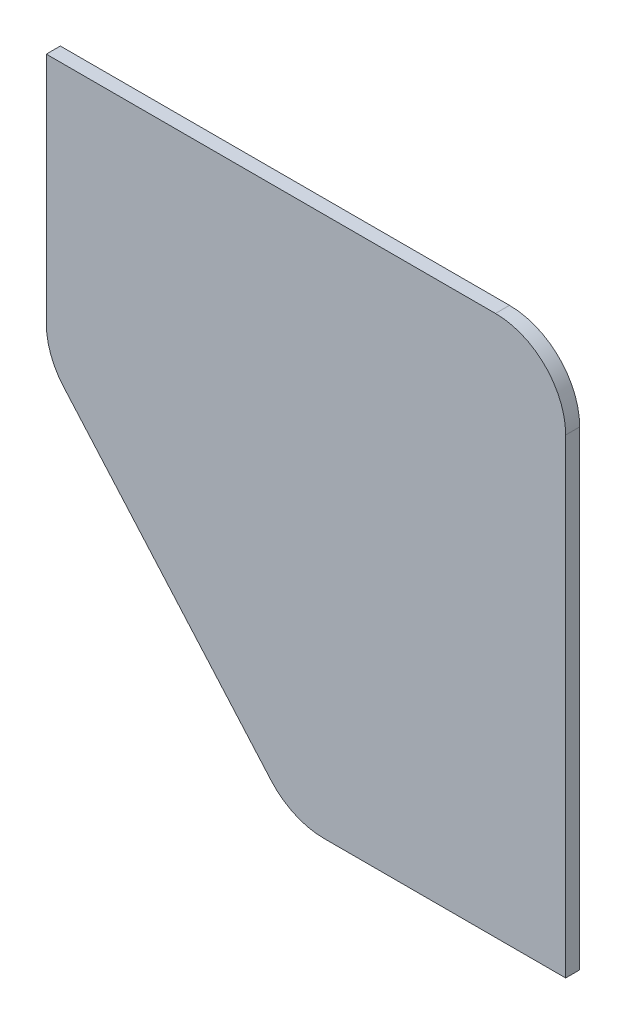
ISO-10303-21;
HEADER;
FILE_DESCRIPTION(('STEP AP214'),'2;1');
FILE_NAME('part.step','',(''),(''),'','','');
FILE_SCHEMA(('AUTOMOTIVE_DESIGN { 1 0 10303 214 1 1 1 1 }'));
ENDSEC;
DATA;
#1=APPLICATION_CONTEXT('core data for automotive mechanical design processes');
#2=APPLICATION_PROTOCOL_DEFINITION('international standard','automotive_design',2000,#1);
#3=PRODUCT_CONTEXT('',#1,'mechanical');
#4=PRODUCT('Part','Part','',(#3));
#5=PRODUCT_RELATED_PRODUCT_CATEGORY('part','',(#4));
#6=PRODUCT_DEFINITION_FORMATION('','',#4);
#7=PRODUCT_DEFINITION_CONTEXT('part definition',#1,'design');
#8=PRODUCT_DEFINITION('design','',#6,#7);
#9=PRODUCT_DEFINITION_SHAPE('','',#8);
#10=(LENGTH_UNIT() NAMED_UNIT(*) SI_UNIT(.MILLI.,.METRE.));
#11=(NAMED_UNIT(*) PLANE_ANGLE_UNIT() SI_UNIT($,.RADIAN.));
#12=(NAMED_UNIT(*) SI_UNIT($,.STERADIAN.) SOLID_ANGLE_UNIT());
#13=UNCERTAINTY_MEASURE_WITH_UNIT(LENGTH_MEASURE(1.E-05),#10,'distance_accuracy_value','');
#14=(GEOMETRIC_REPRESENTATION_CONTEXT(3) GLOBAL_UNCERTAINTY_ASSIGNED_CONTEXT((#13)) GLOBAL_UNIT_ASSIGNED_CONTEXT((#10,
#11,#12)) REPRESENTATION_CONTEXT('',''));
#15=CARTESIAN_POINT('',(0.,0.,0.));
#16=DIRECTION('',(0.,0.,1.));
#17=DIRECTION('',(1.,0.,0.));
#18=AXIS2_PLACEMENT_3D('',#15,#16,#17);
#19=CARTESIAN_POINT('',(-22.1656855955678,34.0263157894737,2.));
#20=DIRECTION('',(0.,0.,-1.));
#21=DIRECTION('',(-1.,0.,0.));
#22=AXIS2_PLACEMENT_3D('',#19,#20,#21);
#23=CYLINDRICAL_SURFACE('',#22,10.);
#24=DIRECTION('',(0.,0.,-1.));
#25=VECTOR('',#24,1.);
#26=CARTESIAN_POINT('',(-22.1656855955678,44.0263157894737,2.));
#27=LINE('',#26,#25);
#28=CARTESIAN_POINT('',(-22.1656855955678,44.0263157894737,2.));
#29=VERTEX_POINT('',#28);
#30=CARTESIAN_POINT('',(-22.1656855955678,44.0263157894737,0.));
#31=VERTEX_POINT('',#30);
#32=EDGE_CURVE('E154',#29,#31,#27,.T.);
#33=ORIENTED_EDGE('',*,*,#32,.F.);
#34=CARTESIAN_POINT('',(-22.1656855955678,34.0263157894737,2.));
#35=DIRECTION('',(0.,0.,1.));
#36=DIRECTION('',(1.,0.,0.));
#37=AXIS2_PLACEMENT_3D('',#34,#35,#36);
#38=CIRCLE('',#37,10.);
#39=CARTESIAN_POINT('',(-12.1656855955678,34.0263157894737,2.));
#40=VERTEX_POINT('',#39);
#41=EDGE_CURVE('E39',#40,#29,#38,.T.);
#42=ORIENTED_EDGE('',*,*,#41,.F.);
#43=DIRECTION('',(0.,0.,-1.));
#44=VECTOR('',#43,1.);
#45=CARTESIAN_POINT('',(-12.1656855955678,34.0263157894737,2.));
#46=LINE('',#45,#44);
#47=CARTESIAN_POINT('',(-12.1656855955678,34.0263157894737,0.));
#48=VERTEX_POINT('',#47);
#49=EDGE_CURVE('E117',#48,#40,#46,.F.);
#50=ORIENTED_EDGE('',*,*,#49,.F.);
#51=CARTESIAN_POINT('',(-22.1656855955678,34.0263157894737,0.));
#52=DIRECTION('',(0.,0.,1.));
#53=DIRECTION('',(1.,0.,0.));
#54=AXIS2_PLACEMENT_3D('',#51,#52,#53);
#55=CIRCLE('',#54,10.);
#56=EDGE_CURVE('E11',#31,#48,#55,.F.);
#57=ORIENTED_EDGE('',*,*,#56,.F.);
#58=EDGE_LOOP('',(#33,#42,#50,#57));
#59=FACE_BOUND('',#58,.T.);
#60=ADVANCED_FACE('F32',(#59),#23,.T.);
#61=CARTESIAN_POINT('',(-46.6280033296495,-22.9736842105263,2.));
#62=DIRECTION('',(0.,0.,1.));
#63=DIRECTION('',(1.,0.,0.));
#64=AXIS2_PLACEMENT_3D('',#61,#62,#63);
#65=CYLINDRICAL_SURFACE('',#64,10.);
#66=DIRECTION('',(0.,0.,-1.));
#67=VECTOR('',#66,1.);
#68=CARTESIAN_POINT('',(-46.6280033296495,-32.9736842105263,2.));
#69=LINE('',#68,#67);
#70=CARTESIAN_POINT('',(-46.6280033296495,-32.9736842105263,2.));
#71=VERTEX_POINT('',#70);
#72=CARTESIAN_POINT('',(-46.6280033296495,-32.9736842105263,0.));
#73=VERTEX_POINT('',#72);
#74=EDGE_CURVE('E146',#71,#73,#69,.T.);
#75=ORIENTED_EDGE('',*,*,#74,.F.);
#76=CARTESIAN_POINT('',(-46.6280033296495,-22.9736842105263,2.));
#77=DIRECTION('',(0.,0.,1.));
#78=DIRECTION('',(1.,0.,0.));
#79=AXIS2_PLACEMENT_3D('',#76,#77,#78);
#80=CIRCLE('',#79,10.);
#81=CARTESIAN_POINT('',(-54.1537702767183,-29.5587302892115,2.));
#82=VERTEX_POINT('',#81);
#83=EDGE_CURVE('E100',#82,#71,#80,.T.);
#84=ORIENTED_EDGE('',*,*,#83,.F.);
#85=DIRECTION('',(0.,0.,-1.));
#86=VECTOR('',#85,1.);
#87=CARTESIAN_POINT('',(-54.1537702767183,-29.5587302892115,2.));
#88=LINE('',#87,#86);
#89=CARTESIAN_POINT('',(-54.1537702767183,-29.5587302892115,0.));
#90=VERTEX_POINT('',#89);
#91=EDGE_CURVE('E148',#90,#82,#88,.F.);
#92=ORIENTED_EDGE('',*,*,#91,.F.);
#93=CARTESIAN_POINT('',(-46.6280033296495,-22.9736842105263,0.));
#94=DIRECTION('',(0.,0.,1.));
#95=DIRECTION('',(1.,0.,0.));
#96=AXIS2_PLACEMENT_3D('',#93,#94,#95);
#97=CIRCLE('',#96,10.);
#98=EDGE_CURVE('E152',#73,#90,#97,.F.);
#99=ORIENTED_EDGE('',*,*,#98,.F.);
#100=EDGE_LOOP('',(#75,#84,#92,#99));
#101=FACE_BOUND('',#100,.T.);
#102=ADVANCED_FACE('F175',(#101),#65,.T.);
#103=CARTESIAN_POINT('',(-76.1656855955678,10.7836669505232,2.));
#104=DIRECTION('',(0.,0.,-1.));
#105=DIRECTION('',(-1.,0.,0.));
#106=AXIS2_PLACEMENT_3D('',#103,#104,#105);
#107=CYLINDRICAL_SURFACE('',#106,10.);
#108=DIRECTION('',(0.,0.,1.));
#109=VECTOR('',#108,1.);
#110=CARTESIAN_POINT('',(-86.1656855955678,10.7836669505232,2.));
#111=LINE('',#110,#109);
#112=CARTESIAN_POINT('',(-86.1656855955678,10.7836669505232,0.));
#113=VERTEX_POINT('',#112);
#114=CARTESIAN_POINT('',(-86.1656855955678,10.7836669505232,2.));
#115=VERTEX_POINT('',#114);
#116=EDGE_CURVE('E136',#113,#115,#111,.T.);
#117=ORIENTED_EDGE('',*,*,#116,.F.);
#118=CARTESIAN_POINT('',(-76.1656855955678,10.7836669505232,0.));
#119=DIRECTION('',(0.,0.,1.));
#120=DIRECTION('',(1.,0.,0.));
#121=AXIS2_PLACEMENT_3D('',#118,#119,#120);
#122=CIRCLE('',#121,10.);
#123=CARTESIAN_POINT('',(-83.6914525426366,4.198620871838,0.));
#124=VERTEX_POINT('',#123);
#125=EDGE_CURVE('E142',#124,#113,#122,.F.);
#126=ORIENTED_EDGE('',*,*,#125,.F.);
#127=DIRECTION('',(0.,0.,1.));
#128=VECTOR('',#127,1.);
#129=CARTESIAN_POINT('',(-83.6914525426366,4.19862087183802,2.));
#130=LINE('',#129,#128);
#131=CARTESIAN_POINT('',(-83.6914525426366,4.198620871838,2.));
#132=VERTEX_POINT('',#131);
#133=EDGE_CURVE('E139',#132,#124,#130,.F.);
#134=ORIENTED_EDGE('',*,*,#133,.F.);
#135=CARTESIAN_POINT('',(-76.1656855955678,10.7836669505232,2.));
#136=DIRECTION('',(0.,0.,1.));
#137=DIRECTION('',(1.,0.,0.));
#138=AXIS2_PLACEMENT_3D('',#135,#136,#137);
#139=CIRCLE('',#138,10.);
#140=EDGE_CURVE('E144',#115,#132,#139,.T.);
#141=ORIENTED_EDGE('',*,*,#140,.F.);
#142=EDGE_LOOP('',(#117,#126,#134,#141));
#143=FACE_BOUND('',#142,.T.);
#144=ADVANCED_FACE('F178',(#143),#107,.T.);
#145=CARTESIAN_POINT('',(-86.1656855955678,44.0263157894737,2.));
#146=DIRECTION('',(1.,0.,0.));
#147=DIRECTION('',(0.,0.,-1.));
#148=AXIS2_PLACEMENT_3D('',#145,#146,#147);
#149=PLANE('',#148);
#150=DIRECTION('',(0.,-1.,0.));
#151=VECTOR('',#150,1.);
#152=CARTESIAN_POINT('',(-86.1656855955678,44.0263157894737,0.));
#153=LINE('',#152,#151);
#154=CARTESIAN_POINT('',(-86.1656855955678,44.0263157894737,0.));
#155=VERTEX_POINT('',#154);
#156=EDGE_CURVE('E123',#155,#113,#153,.T.);
#157=ORIENTED_EDGE('',*,*,#156,.T.);
#158=ORIENTED_EDGE('',*,*,#116,.T.);
#159=DIRECTION('',(0.,-1.,0.));
#160=VECTOR('',#159,1.);
#161=CARTESIAN_POINT('',(-86.1656855955678,44.0263157894737,2.));
#162=LINE('',#161,#160);
#163=CARTESIAN_POINT('',(-86.1656855955678,44.0263157894737,2.));
#164=VERTEX_POINT('',#163);
#165=EDGE_CURVE('E104',#164,#115,#162,.T.);
#166=ORIENTED_EDGE('',*,*,#165,.F.);
#167=DIRECTION('',(0.,0.,-1.));
#168=VECTOR('',#167,1.);
#169=CARTESIAN_POINT('',(-86.1656855955678,44.0263157894737,2.));
#170=LINE('',#169,#168);
#171=EDGE_CURVE('E114',#164,#155,#170,.T.);
#172=ORIENTED_EDGE('',*,*,#171,.T.);
#173=EDGE_LOOP('',(#157,#158,#166,#172));
#174=FACE_BOUND('',#173,.T.);
#175=ADVANCED_FACE('F165',(#174),#149,.F.);
#176=CARTESIAN_POINT('',(-86.1656855955678,-32.9736842105263,2.));
#177=DIRECTION('',(0.,1.,0.));
#178=DIRECTION('',(0.,0.,1.));
#179=AXIS2_PLACEMENT_3D('',#176,#177,#178);
#180=PLANE('',#179);
#181=DIRECTION('',(1.,0.,0.));
#182=VECTOR('',#181,1.);
#183=CARTESIAN_POINT('',(-86.1656855955678,-32.9736842105263,2.));
#184=LINE('',#183,#182);
#185=CARTESIAN_POINT('',(-12.1656855955678,-32.9736842105263,2.));
#186=VERTEX_POINT('',#185);
#187=EDGE_CURVE('E94',#71,#186,#184,.T.);
#188=ORIENTED_EDGE('',*,*,#187,.F.);
#189=ORIENTED_EDGE('',*,*,#74,.T.);
#190=DIRECTION('',(1.,0.,0.));
#191=VECTOR('',#190,1.);
#192=CARTESIAN_POINT('',(-86.1656855955678,-32.9736842105263,0.));
#193=LINE('',#192,#191);
#194=CARTESIAN_POINT('',(-12.1656855955678,-32.9736842105263,0.));
#195=VERTEX_POINT('',#194);
#196=EDGE_CURVE('E110',#73,#195,#193,.T.);
#197=ORIENTED_EDGE('',*,*,#196,.T.);
#198=DIRECTION('',(0.,0.,-1.));
#199=VECTOR('',#198,1.);
#200=CARTESIAN_POINT('',(-12.1656855955678,-32.9736842105263,2.));
#201=LINE('',#200,#199);
#202=EDGE_CURVE('E107',#186,#195,#201,.T.);
#203=ORIENTED_EDGE('',*,*,#202,.F.);
#204=EDGE_LOOP('',(#188,#189,#197,#203));
#205=FACE_BOUND('',#204,.T.);
#206=ADVANCED_FACE('F108',(#205),#180,.F.);
#207=CARTESIAN_POINT('',(0.,0.,2.));
#208=DIRECTION('',(0.,0.,1.));
#209=DIRECTION('',(1.,0.,0.));
#210=AXIS2_PLACEMENT_3D('',#207,#208,#209);
#211=PLANE('',#210);
#212=DIRECTION('',(0.,1.,0.));
#213=VECTOR('',#212,1.);
#214=CARTESIAN_POINT('',(-12.1656855955678,44.0263157894737,2.));
#215=LINE('',#214,#213);
#216=EDGE_CURVE('E98',#186,#40,#215,.T.);
#217=ORIENTED_EDGE('',*,*,#216,.T.);
#218=ORIENTED_EDGE('',*,*,#41,.T.);
#219=DIRECTION('',(-1.,0.,0.));
#220=VECTOR('',#219,1.);
#221=CARTESIAN_POINT('',(-86.1656855955678,44.0263157894737,2.));
#222=LINE('',#221,#220);
#223=EDGE_CURVE('E118',#29,#164,#222,.T.);
#224=ORIENTED_EDGE('',*,*,#223,.T.);
#225=ORIENTED_EDGE('',*,*,#165,.T.);
#226=ORIENTED_EDGE('',*,*,#140,.T.);
#227=DIRECTION('',(0.658504607868518,-0.752576694706878,0.));
#228=VECTOR('',#227,1.);
#229=CARTESIAN_POINT('',(-45.319736229255,-39.6547692005981,2.));
#230=LINE('',#229,#228);
#231=EDGE_CURVE('E126',#132,#82,#230,.T.);
#232=ORIENTED_EDGE('',*,*,#231,.T.);
#233=ORIENTED_EDGE('',*,*,#83,.T.);
#234=ORIENTED_EDGE('',*,*,#187,.T.);
#235=EDGE_LOOP('',(#217,#218,#224,#225,#226,#232,#233,#234));
#236=FACE_BOUND('',#235,.T.);
#237=ADVANCED_FACE('F96',(#236),#211,.T.);
#238=CARTESIAN_POINT('',(0.,0.,0.));
#239=DIRECTION('',(0.,0.,1.));
#240=DIRECTION('',(1.,0.,0.));
#241=AXIS2_PLACEMENT_3D('',#238,#239,#240);
#242=PLANE('',#241);
#243=DIRECTION('',(-1.,0.,0.));
#244=VECTOR('',#243,1.);
#245=CARTESIAN_POINT('',(-86.1656855955678,44.0263157894737,0.));
#246=LINE('',#245,#244);
#247=EDGE_CURVE('E130',#31,#155,#246,.T.);
#248=ORIENTED_EDGE('',*,*,#247,.F.);
#249=ORIENTED_EDGE('',*,*,#56,.T.);
#250=DIRECTION('',(0.,1.,0.));
#251=VECTOR('',#250,1.);
#252=CARTESIAN_POINT('',(-12.1656855955678,44.0263157894737,0.));
#253=LINE('',#252,#251);
#254=EDGE_CURVE('E128',#195,#48,#253,.T.);
#255=ORIENTED_EDGE('',*,*,#254,.F.);
#256=ORIENTED_EDGE('',*,*,#196,.F.);
#257=ORIENTED_EDGE('',*,*,#98,.T.);
#258=DIRECTION('',(0.658504607868518,-0.752576694706878,0.));
#259=VECTOR('',#258,1.);
#260=CARTESIAN_POINT('',(-45.319736229255,-39.6547692005981,0.));
#261=LINE('',#260,#259);
#262=EDGE_CURVE('E113',#124,#90,#261,.T.);
#263=ORIENTED_EDGE('',*,*,#262,.F.);
#264=ORIENTED_EDGE('',*,*,#125,.T.);
#265=ORIENTED_EDGE('',*,*,#156,.F.);
#266=EDGE_LOOP('',(#248,#249,#255,#256,#257,#263,#264,#265));
#267=FACE_BOUND('',#266,.T.);
#268=ADVANCED_FACE('F176',(#267),#242,.F.);
#269=CARTESIAN_POINT('',(-12.1656855955678,44.0263157894737,2.));
#270=DIRECTION('',(-1.,0.,0.));
#271=DIRECTION('',(0.,-1.,0.));
#272=AXIS2_PLACEMENT_3D('',#269,#270,#271);
#273=PLANE('',#272);
#274=ORIENTED_EDGE('',*,*,#254,.T.);
#275=ORIENTED_EDGE('',*,*,#49,.T.);
#276=ORIENTED_EDGE('',*,*,#216,.F.);
#277=ORIENTED_EDGE('',*,*,#202,.T.);
#278=EDGE_LOOP('',(#274,#275,#276,#277));
#279=FACE_BOUND('',#278,.T.);
#280=ADVANCED_FACE('F116',(#279),#273,.F.);
#281=CARTESIAN_POINT('',(-86.1656855955678,44.0263157894737,2.));
#282=DIRECTION('',(0.,-1.,0.));
#283=DIRECTION('',(0.,0.,-1.));
#284=AXIS2_PLACEMENT_3D('',#281,#282,#283);
#285=PLANE('',#284);
#286=ORIENTED_EDGE('',*,*,#223,.F.);
#287=ORIENTED_EDGE('',*,*,#32,.T.);
#288=ORIENTED_EDGE('',*,*,#247,.T.);
#289=ORIENTED_EDGE('',*,*,#171,.F.);
#290=EDGE_LOOP('',(#286,#287,#288,#289));
#291=FACE_BOUND('',#290,.T.);
#292=ADVANCED_FACE('F161',(#291),#285,.F.);
#293=CARTESIAN_POINT('',(-51.1656855955678,-32.9736842105263,138.016150708444));
#294=DIRECTION('',(-0.752576694706878,-0.658504607868518,0.));
#295=DIRECTION('',(0.658504607868518,-0.752576694706878,0.));
#296=AXIS2_PLACEMENT_3D('',#293,#294,#295);
#297=PLANE('',#296);
#298=ORIENTED_EDGE('',*,*,#262,.T.);
#299=ORIENTED_EDGE('',*,*,#91,.T.);
#300=ORIENTED_EDGE('',*,*,#231,.F.);
#301=ORIENTED_EDGE('',*,*,#133,.T.);
#302=EDGE_LOOP('',(#298,#299,#300,#301));
#303=FACE_BOUND('',#302,.T.);
#304=ADVANCED_FACE('F171',(#303),#297,.T.);
#305=CLOSED_SHELL('',(#60,#102,#144,#175,#206,#237,#268,#280,#292,#304));
#306=MANIFOLD_SOLID_BREP('B2',#305);
#307=ADVANCED_BREP_SHAPE_REPRESENTATION('',(#18,#306),#14);
#308=SHAPE_DEFINITION_REPRESENTATION(#9,#307);
ENDSEC;
END-ISO-10303-21;
